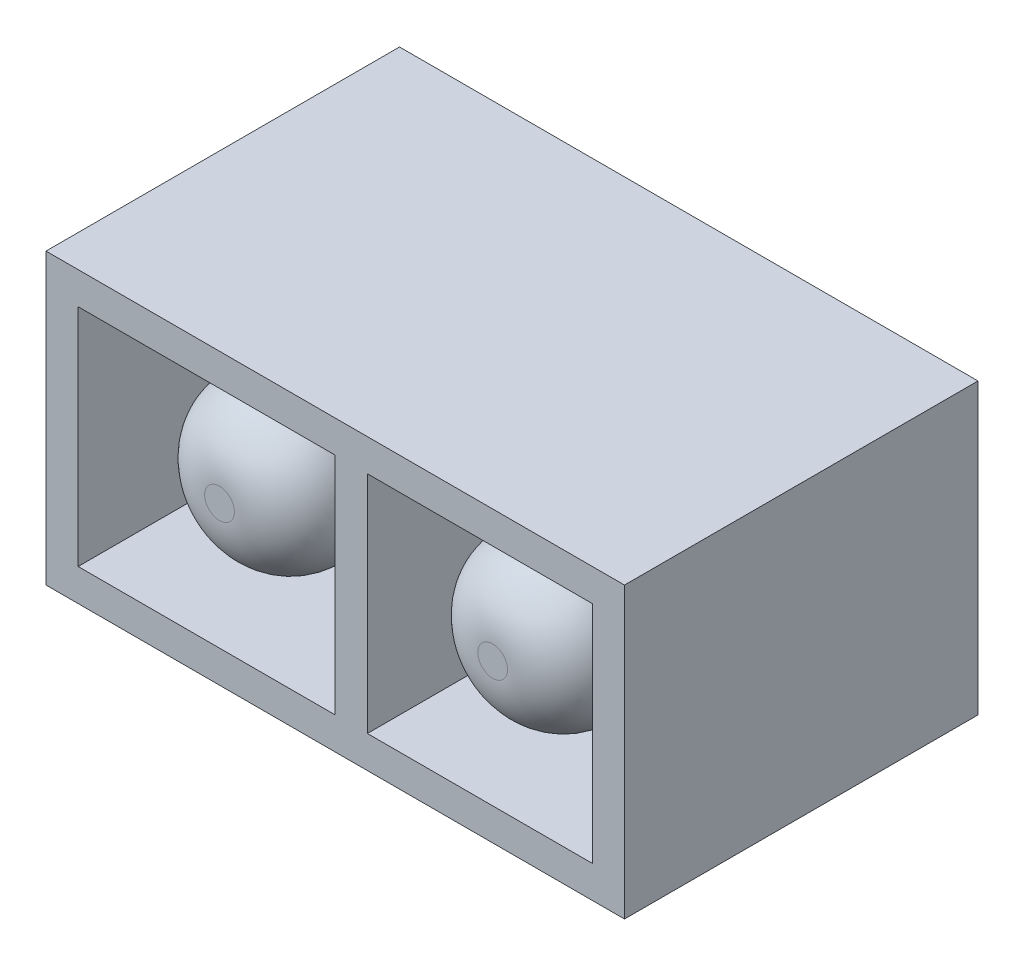
ISO-10303-21;
HEADER;
FILE_DESCRIPTION(('STEP AP214'),'2;1');
FILE_NAME('part.step','',(''),(''),'','','');
FILE_SCHEMA(('AUTOMOTIVE_DESIGN { 1 0 10303 214 1 1 1 1 }'));
ENDSEC;
DATA;
#1=APPLICATION_CONTEXT('core data for automotive mechanical design processes');
#2=APPLICATION_PROTOCOL_DEFINITION('international standard','automotive_design',2000,#1);
#3=PRODUCT_CONTEXT('',#1,'mechanical');
#4=PRODUCT('Part','Part','',(#3));
#5=PRODUCT_RELATED_PRODUCT_CATEGORY('part','',(#4));
#6=PRODUCT_DEFINITION_FORMATION('','',#4);
#7=PRODUCT_DEFINITION_CONTEXT('part definition',#1,'design');
#8=PRODUCT_DEFINITION('design','',#6,#7);
#9=PRODUCT_DEFINITION_SHAPE('','',#8);
#10=(LENGTH_UNIT() NAMED_UNIT(*) SI_UNIT(.MILLI.,.METRE.));
#11=(NAMED_UNIT(*) PLANE_ANGLE_UNIT() SI_UNIT($,.RADIAN.));
#12=(NAMED_UNIT(*) SI_UNIT($,.STERADIAN.) SOLID_ANGLE_UNIT());
#13=UNCERTAINTY_MEASURE_WITH_UNIT(LENGTH_MEASURE(1.E-05),#10,'distance_accuracy_value','');
#14=(GEOMETRIC_REPRESENTATION_CONTEXT(3) GLOBAL_UNCERTAINTY_ASSIGNED_CONTEXT((#13)) GLOBAL_UNIT_ASSIGNED_CONTEXT((#10,
#11,#12)) REPRESENTATION_CONTEXT('',''));
#15=CARTESIAN_POINT('',(0.,0.,0.));
#16=DIRECTION('',(0.,0.,1.));
#17=DIRECTION('',(1.,0.,0.));
#18=AXIS2_PLACEMENT_3D('',#15,#16,#17);
#19=CARTESIAN_POINT('',(0.,2.25,5.));
#20=DIRECTION('',(1.,0.,0.));
#21=DIRECTION('',(0.,1.,0.));
#22=AXIS2_PLACEMENT_3D('',#19,#20,#21);
#23=PLANE('',#22);
#24=DIRECTION('',(0.,-1.,0.));
#25=VECTOR('',#24,1.);
#26=CARTESIAN_POINT('',(0.,2.25,0.));
#27=LINE('',#26,#25);
#28=CARTESIAN_POINT('',(0.,1.75,0.));
#29=VERTEX_POINT('',#28);
#30=CARTESIAN_POINT('',(0.,-1.75,0.));
#31=VERTEX_POINT('',#30);
#32=EDGE_CURVE('E270',#29,#31,#27,.T.);
#33=ORIENTED_EDGE('',*,*,#32,.T.);
#34=DIRECTION('',(0.,0.,1.));
#35=VECTOR('',#34,1.);
#36=CARTESIAN_POINT('',(0.,-1.75,5.));
#37=LINE('',#36,#35);
#38=CARTESIAN_POINT('',(0.,-1.75,5.));
#39=VERTEX_POINT('',#38);
#40=EDGE_CURVE('E240',#31,#39,#37,.T.);
#41=ORIENTED_EDGE('',*,*,#40,.T.);
#42=DIRECTION('',(0.,-1.,0.));
#43=VECTOR('',#42,1.);
#44=CARTESIAN_POINT('',(0.,2.25,5.));
#45=LINE('',#44,#43);
#46=CARTESIAN_POINT('',(0.,1.75,5.));
#47=VERTEX_POINT('',#46);
#48=EDGE_CURVE('E190',#47,#39,#45,.T.);
#49=ORIENTED_EDGE('',*,*,#48,.F.);
#50=DIRECTION('',(0.,0.,-1.));
#51=VECTOR('',#50,1.);
#52=CARTESIAN_POINT('',(0.,1.75,5.));
#53=LINE('',#52,#51);
#54=EDGE_CURVE('E233',#47,#29,#53,.T.);
#55=ORIENTED_EDGE('',*,*,#54,.T.);
#56=EDGE_LOOP('',(#33,#41,#49,#55));
#57=FACE_BOUND('',#56,.T.);
#58=ADVANCED_FACE('F73',(#57),#23,.F.);
#59=CARTESIAN_POINT('',(0.5,-2.25,5.));
#60=DIRECTION('',(0.,-1.,0.));
#61=DIRECTION('',(0.,0.,-1.));
#62=AXIS2_PLACEMENT_3D('',#59,#60,#61);
#63=PLANE('',#62);
#64=DIRECTION('',(-1.,0.,0.));
#65=VECTOR('',#64,1.);
#66=CARTESIAN_POINT('',(0.5,-2.25,5.));
#67=LINE('',#66,#65);
#68=CARTESIAN_POINT('',(4.5,-2.25,5.));
#69=VERTEX_POINT('',#68);
#70=CARTESIAN_POINT('',(-4.5,-2.25,5.));
#71=VERTEX_POINT('',#70);
#72=EDGE_CURVE('E273',#69,#71,#67,.T.);
#73=ORIENTED_EDGE('',*,*,#72,.T.);
#74=DIRECTION('',(0.,0.,1.));
#75=VECTOR('',#74,1.);
#76=CARTESIAN_POINT('',(-4.5,-2.25,-0.5));
#77=LINE('',#76,#75);
#78=CARTESIAN_POINT('',(-4.5,-2.25,-0.5));
#79=VERTEX_POINT('',#78);
#80=EDGE_CURVE('E266',#79,#71,#77,.T.);
#81=ORIENTED_EDGE('',*,*,#80,.F.);
#82=DIRECTION('',(-1.,0.,0.));
#83=VECTOR('',#82,1.);
#84=CARTESIAN_POINT('',(4.5,-2.25,-0.5));
#85=LINE('',#84,#83);
#86=CARTESIAN_POINT('',(4.5,-2.25,-0.5));
#87=VERTEX_POINT('',#86);
#88=EDGE_CURVE('E243',#87,#79,#85,.T.);
#89=ORIENTED_EDGE('',*,*,#88,.F.);
#90=DIRECTION('',(0.,0.,1.));
#91=VECTOR('',#90,1.);
#92=CARTESIAN_POINT('',(4.5,-2.25,-0.5));
#93=LINE('',#92,#91);
#94=EDGE_CURVE('E254',#87,#69,#93,.T.);
#95=ORIENTED_EDGE('',*,*,#94,.T.);
#96=EDGE_LOOP('',(#73,#81,#89,#95));
#97=FACE_BOUND('',#96,.T.);
#98=ADVANCED_FACE('F326',(#97),#63,.T.);
#99=CARTESIAN_POINT('',(0.499999999999999,2.25,5.));
#100=DIRECTION('',(1.,0.,0.));
#101=DIRECTION('',(0.,1.,0.));
#102=AXIS2_PLACEMENT_3D('',#99,#100,#101);
#103=PLANE('',#102);
#104=DIRECTION('',(0.,0.,1.));
#105=VECTOR('',#104,1.);
#106=CARTESIAN_POINT('',(0.5,-1.75,5.));
#107=LINE('',#106,#105);
#108=CARTESIAN_POINT('',(0.5,-1.75,0.));
#109=VERTEX_POINT('',#108);
#110=CARTESIAN_POINT('',(0.5,-1.75,5.));
#111=VERTEX_POINT('',#110);
#112=EDGE_CURVE('E237',#109,#111,#107,.T.);
#113=ORIENTED_EDGE('',*,*,#112,.F.);
#114=DIRECTION('',(0.,-1.,0.));
#115=VECTOR('',#114,1.);
#116=CARTESIAN_POINT('',(0.499999999999999,2.25,0.));
#117=LINE('',#116,#115);
#118=CARTESIAN_POINT('',(0.5,1.75,0.));
#119=VERTEX_POINT('',#118);
#120=EDGE_CURVE('E274',#119,#109,#117,.T.);
#121=ORIENTED_EDGE('',*,*,#120,.F.);
#122=DIRECTION('',(0.,0.,-1.));
#123=VECTOR('',#122,1.);
#124=CARTESIAN_POINT('',(0.5,1.75,5.));
#125=LINE('',#124,#123);
#126=CARTESIAN_POINT('',(0.5,1.75,5.));
#127=VERTEX_POINT('',#126);
#128=EDGE_CURVE('E230',#127,#119,#125,.T.);
#129=ORIENTED_EDGE('',*,*,#128,.F.);
#130=DIRECTION('',(0.,-1.,0.));
#131=VECTOR('',#130,1.);
#132=CARTESIAN_POINT('',(0.499999999999999,2.25,5.));
#133=LINE('',#132,#131);
#134=EDGE_CURVE('E277',#127,#111,#133,.T.);
#135=ORIENTED_EDGE('',*,*,#134,.T.);
#136=EDGE_LOOP('',(#113,#121,#129,#135));
#137=FACE_BOUND('',#136,.T.);
#138=ADVANCED_FACE('F332',(#137),#103,.T.);
#139=CARTESIAN_POINT('',(0.,2.25,5.));
#140=DIRECTION('',(0.,1.,0.));
#141=DIRECTION('',(0.,0.,1.));
#142=AXIS2_PLACEMENT_3D('',#139,#140,#141);
#143=PLANE('',#142);
#144=DIRECTION('',(1.,0.,0.));
#145=VECTOR('',#144,1.);
#146=CARTESIAN_POINT('',(0.,2.25,5.));
#147=LINE('',#146,#145);
#148=CARTESIAN_POINT('',(-4.5,2.25,5.));
#149=VERTEX_POINT('',#148);
#150=CARTESIAN_POINT('',(4.5,2.25,5.));
#151=VERTEX_POINT('',#150);
#152=EDGE_CURVE('E281',#149,#151,#147,.T.);
#153=ORIENTED_EDGE('',*,*,#152,.T.);
#154=DIRECTION('',(0.,0.,1.));
#155=VECTOR('',#154,1.);
#156=CARTESIAN_POINT('',(4.5,2.25,-0.5));
#157=LINE('',#156,#155);
#158=CARTESIAN_POINT('',(4.5,2.25,-0.5));
#159=VERTEX_POINT('',#158);
#160=EDGE_CURVE('E258',#159,#151,#157,.T.);
#161=ORIENTED_EDGE('',*,*,#160,.F.);
#162=DIRECTION('',(1.,0.,0.));
#163=VECTOR('',#162,1.);
#164=CARTESIAN_POINT('',(4.5,2.25,-0.5));
#165=LINE('',#164,#163);
#166=CARTESIAN_POINT('',(-4.5,2.25,-0.5));
#167=VERTEX_POINT('',#166);
#168=EDGE_CURVE('E249',#167,#159,#165,.T.);
#169=ORIENTED_EDGE('',*,*,#168,.F.);
#170=DIRECTION('',(0.,0.,1.));
#171=VECTOR('',#170,1.);
#172=CARTESIAN_POINT('',(-4.5,2.25,-0.5));
#173=LINE('',#172,#171);
#174=EDGE_CURVE('E262',#167,#149,#173,.T.);
#175=ORIENTED_EDGE('',*,*,#174,.T.);
#176=EDGE_LOOP('',(#153,#161,#169,#175));
#177=FACE_BOUND('',#176,.T.);
#178=ADVANCED_FACE('F338',(#177),#143,.T.);
#179=CARTESIAN_POINT('',(0.,0.,5.));
#180=DIRECTION('',(0.,0.,-1.));
#181=DIRECTION('',(-1.,0.,0.));
#182=AXIS2_PLACEMENT_3D('',#179,#180,#181);
#183=PLANE('',#182);
#184=DIRECTION('',(-1.,0.,0.));
#185=VECTOR('',#184,1.);
#186=CARTESIAN_POINT('',(0.,1.75,5.));
#187=LINE('',#186,#185);
#188=CARTESIAN_POINT('',(-4.,1.75,5.));
#189=VERTEX_POINT('',#188);
#190=EDGE_CURVE('E197',#47,#189,#187,.T.);
#191=ORIENTED_EDGE('',*,*,#190,.F.);
#192=ORIENTED_EDGE('',*,*,#48,.T.);
#193=DIRECTION('',(1.,0.,0.));
#194=VECTOR('',#193,1.);
#195=CARTESIAN_POINT('',(0.,-1.75,5.));
#196=LINE('',#195,#194);
#197=CARTESIAN_POINT('',(-4.,-1.75,5.));
#198=VERTEX_POINT('',#197);
#199=EDGE_CURVE('E178',#198,#39,#196,.T.);
#200=ORIENTED_EDGE('',*,*,#199,.F.);
#201=DIRECTION('',(0.,-1.,0.));
#202=VECTOR('',#201,1.);
#203=CARTESIAN_POINT('',(-4.,0.,5.));
#204=LINE('',#203,#202);
#205=EDGE_CURVE('E164',#189,#198,#204,.T.);
#206=ORIENTED_EDGE('',*,*,#205,.F.);
#207=EDGE_LOOP('',(#191,#192,#200,#206));
#208=FACE_BOUND('',#207,.T.);
#209=ORIENTED_EDGE('',*,*,#134,.F.);
#210=CARTESIAN_POINT('',(4.,1.75,5.));
#211=VERTEX_POINT('',#210);
#212=EDGE_CURVE('E200',#211,#127,#187,.T.);
#213=ORIENTED_EDGE('',*,*,#212,.F.);
#214=DIRECTION('',(0.,1.,0.));
#215=VECTOR('',#214,1.);
#216=CARTESIAN_POINT('',(4.,0.,5.));
#217=LINE('',#216,#215);
#218=CARTESIAN_POINT('',(4.,-1.75,5.));
#219=VERTEX_POINT('',#218);
#220=EDGE_CURVE('E192',#219,#211,#217,.T.);
#221=ORIENTED_EDGE('',*,*,#220,.F.);
#222=EDGE_CURVE('E173',#111,#219,#196,.T.);
#223=ORIENTED_EDGE('',*,*,#222,.F.);
#224=EDGE_LOOP('',(#209,#213,#221,#223));
#225=FACE_BOUND('',#224,.T.);
#226=ORIENTED_EDGE('',*,*,#152,.F.);
#227=DIRECTION('',(0.,-1.,0.));
#228=VECTOR('',#227,1.);
#229=CARTESIAN_POINT('',(-4.5,2.25,5.));
#230=LINE('',#229,#228);
#231=EDGE_CURVE('E183',#149,#71,#230,.T.);
#232=ORIENTED_EDGE('',*,*,#231,.T.);
#233=ORIENTED_EDGE('',*,*,#72,.F.);
#234=DIRECTION('',(0.,1.,0.));
#235=VECTOR('',#234,1.);
#236=CARTESIAN_POINT('',(4.5,2.25,5.));
#237=LINE('',#236,#235);
#238=EDGE_CURVE('E226',#69,#151,#237,.T.);
#239=ORIENTED_EDGE('',*,*,#238,.T.);
#240=EDGE_LOOP('',(#226,#232,#233,#239));
#241=FACE_BOUND('',#240,.T.);
#242=ADVANCED_FACE('F187',(#208,#225,#241),#183,.F.);
#243=CARTESIAN_POINT('',(0.,0.,0.));
#244=DIRECTION('',(0.,0.,-1.));
#245=DIRECTION('',(-1.,0.,0.));
#246=AXIS2_PLACEMENT_3D('',#243,#244,#245);
#247=PLANE('',#246);
#248=CARTESIAN_POINT('',(2.25,0.,0.));
#249=DIRECTION('',(0.,0.,-1.));
#250=DIRECTION('',(-1.,0.,0.));
#251=AXIS2_PLACEMENT_3D('',#248,#249,#250);
#252=CIRCLE('',#251,1.5);
#253=CARTESIAN_POINT('',(0.75,0.,0.));
#254=VERTEX_POINT('',#253);
#255=EDGE_CURVE('E294',#254,#254,#252,.F.);
#256=ORIENTED_EDGE('',*,*,#255,.F.);
#257=EDGE_LOOP('',(#256));
#258=FACE_BOUND('',#257,.T.);
#259=ORIENTED_EDGE('',*,*,#120,.T.);
#260=DIRECTION('',(1.,0.,0.));
#261=VECTOR('',#260,1.);
#262=CARTESIAN_POINT('',(0.,-1.75,0.));
#263=LINE('',#262,#261);
#264=CARTESIAN_POINT('',(4.,-1.75,0.));
#265=VERTEX_POINT('',#264);
#266=EDGE_CURVE('E206',#109,#265,#263,.T.);
#267=ORIENTED_EDGE('',*,*,#266,.T.);
#268=DIRECTION('',(0.,1.,0.));
#269=VECTOR('',#268,1.);
#270=CARTESIAN_POINT('',(4.,0.,0.));
#271=LINE('',#270,#269);
#272=CARTESIAN_POINT('',(4.,1.75,0.));
#273=VERTEX_POINT('',#272);
#274=EDGE_CURVE('E209',#265,#273,#271,.T.);
#275=ORIENTED_EDGE('',*,*,#274,.T.);
#276=DIRECTION('',(-1.,0.,0.));
#277=VECTOR('',#276,1.);
#278=CARTESIAN_POINT('',(0.,1.75,0.));
#279=LINE('',#278,#277);
#280=EDGE_CURVE('E174',#273,#119,#279,.T.);
#281=ORIENTED_EDGE('',*,*,#280,.T.);
#282=EDGE_LOOP('',(#259,#267,#275,#281));
#283=FACE_BOUND('',#282,.T.);
#284=ADVANCED_FACE('F345',(#258,#283),#247,.F.);
#285=CARTESIAN_POINT('',(-4.5,-2.25,-0.5));
#286=DIRECTION('',(1.,0.,0.));
#287=DIRECTION('',(0.,0.,-1.));
#288=AXIS2_PLACEMENT_3D('',#285,#286,#287);
#289=PLANE('',#288);
#290=ORIENTED_EDGE('',*,*,#80,.T.);
#291=ORIENTED_EDGE('',*,*,#231,.F.);
#292=ORIENTED_EDGE('',*,*,#174,.F.);
#293=DIRECTION('',(0.,1.,0.));
#294=VECTOR('',#293,1.);
#295=CARTESIAN_POINT('',(-4.5,-2.25,-0.5));
#296=LINE('',#295,#294);
#297=EDGE_CURVE('E246',#79,#167,#296,.T.);
#298=ORIENTED_EDGE('',*,*,#297,.F.);
#299=EDGE_LOOP('',(#290,#291,#292,#298));
#300=FACE_BOUND('',#299,.T.);
#301=ADVANCED_FACE('F346',(#300),#289,.F.);
#302=CARTESIAN_POINT('',(4.5,-2.25,-0.5));
#303=DIRECTION('',(-1.,0.,0.));
#304=DIRECTION('',(0.,0.,1.));
#305=AXIS2_PLACEMENT_3D('',#302,#303,#304);
#306=PLANE('',#305);
#307=ORIENTED_EDGE('',*,*,#160,.T.);
#308=ORIENTED_EDGE('',*,*,#238,.F.);
#309=ORIENTED_EDGE('',*,*,#94,.F.);
#310=DIRECTION('',(0.,-1.,0.));
#311=VECTOR('',#310,1.);
#312=CARTESIAN_POINT('',(4.5,-2.25,-0.5));
#313=LINE('',#312,#311);
#314=EDGE_CURVE('E97',#159,#87,#313,.T.);
#315=ORIENTED_EDGE('',*,*,#314,.F.);
#316=EDGE_LOOP('',(#307,#308,#309,#315));
#317=FACE_BOUND('',#316,.T.);
#318=ADVANCED_FACE('F349',(#317),#306,.F.);
#319=CARTESIAN_POINT('',(0.,0.,-0.5));
#320=DIRECTION('',(0.,0.,-1.));
#321=DIRECTION('',(-1.,0.,0.));
#322=AXIS2_PLACEMENT_3D('',#319,#320,#321);
#323=PLANE('',#322);
#324=ORIENTED_EDGE('',*,*,#88,.T.);
#325=ORIENTED_EDGE('',*,*,#297,.T.);
#326=ORIENTED_EDGE('',*,*,#168,.T.);
#327=ORIENTED_EDGE('',*,*,#314,.T.);
#328=EDGE_LOOP('',(#324,#325,#326,#327));
#329=FACE_BOUND('',#328,.T.);
#330=ADVANCED_FACE('F353',(#329),#323,.T.);
#331=CARTESIAN_POINT('',(-2.,0.,0.));
#332=DIRECTION('',(0.,0.,-1.));
#333=DIRECTION('',(-1.,0.,0.));
#334=AXIS2_PLACEMENT_3D('',#331,#332,#333);
#335=CIRCLE('',#334,1.5);
#336=CARTESIAN_POINT('',(-3.5,0.,0.));
#337=VERTEX_POINT('',#336);
#338=EDGE_CURVE('E298',#337,#337,#335,.F.);
#339=ORIENTED_EDGE('',*,*,#338,.F.);
#340=EDGE_LOOP('',(#339));
#341=FACE_BOUND('',#340,.T.);
#342=DIRECTION('',(0.,-1.,0.));
#343=VECTOR('',#342,1.);
#344=CARTESIAN_POINT('',(-4.,0.,0.));
#345=LINE('',#344,#343);
#346=CARTESIAN_POINT('',(-4.,1.75,0.));
#347=VERTEX_POINT('',#346);
#348=CARTESIAN_POINT('',(-4.,-1.75,0.));
#349=VERTEX_POINT('',#348);
#350=EDGE_CURVE('E203',#347,#349,#345,.T.);
#351=ORIENTED_EDGE('',*,*,#350,.T.);
#352=EDGE_CURVE('E181',#349,#31,#263,.T.);
#353=ORIENTED_EDGE('',*,*,#352,.T.);
#354=ORIENTED_EDGE('',*,*,#32,.F.);
#355=DIRECTION('',(-1.,0.,0.));
#356=VECTOR('',#355,1.);
#357=CARTESIAN_POINT('',(0.,1.75,0.));
#358=LINE('',#357,#356);
#359=EDGE_CURVE('E284',#29,#347,#358,.T.);
#360=ORIENTED_EDGE('',*,*,#359,.T.);
#361=EDGE_LOOP('',(#351,#353,#354,#360));
#362=FACE_BOUND('',#361,.T.);
#363=ADVANCED_FACE('F355',(#341,#362),#247,.F.);
#364=CARTESIAN_POINT('',(0.,-1.75,5.));
#365=DIRECTION('',(0.,1.,0.));
#366=DIRECTION('',(0.,0.,1.));
#367=AXIS2_PLACEMENT_3D('',#364,#365,#366);
#368=PLANE('',#367);
#369=ORIENTED_EDGE('',*,*,#40,.F.);
#370=ORIENTED_EDGE('',*,*,#352,.F.);
#371=DIRECTION('',(0.,0.,-1.));
#372=VECTOR('',#371,1.);
#373=CARTESIAN_POINT('',(-4.,-1.75,5.));
#374=LINE('',#373,#372);
#375=EDGE_CURVE('E167',#198,#349,#374,.T.);
#376=ORIENTED_EDGE('',*,*,#375,.F.);
#377=ORIENTED_EDGE('',*,*,#199,.T.);
#378=EDGE_LOOP('',(#369,#370,#376,#377));
#379=FACE_BOUND('',#378,.T.);
#380=ADVANCED_FACE('F177',(#379),#368,.T.);
#381=CARTESIAN_POINT('',(0.,1.75,5.));
#382=DIRECTION('',(0.,-1.,0.));
#383=DIRECTION('',(0.,0.,-1.));
#384=AXIS2_PLACEMENT_3D('',#381,#382,#383);
#385=PLANE('',#384);
#386=ORIENTED_EDGE('',*,*,#54,.F.);
#387=ORIENTED_EDGE('',*,*,#190,.T.);
#388=DIRECTION('',(0.,0.,-1.));
#389=VECTOR('',#388,1.);
#390=CARTESIAN_POINT('',(-4.,1.75,5.));
#391=LINE('',#390,#389);
#392=EDGE_CURVE('E89',#189,#347,#391,.T.);
#393=ORIENTED_EDGE('',*,*,#392,.T.);
#394=ORIENTED_EDGE('',*,*,#359,.F.);
#395=EDGE_LOOP('',(#386,#387,#393,#394));
#396=FACE_BOUND('',#395,.T.);
#397=ADVANCED_FACE('F364',(#396),#385,.T.);
#398=CARTESIAN_POINT('',(-4.,0.,5.));
#399=DIRECTION('',(1.,0.,0.));
#400=DIRECTION('',(0.,0.,-1.));
#401=AXIS2_PLACEMENT_3D('',#398,#399,#400);
#402=PLANE('',#401);
#403=ORIENTED_EDGE('',*,*,#350,.F.);
#404=ORIENTED_EDGE('',*,*,#392,.F.);
#405=ORIENTED_EDGE('',*,*,#205,.T.);
#406=ORIENTED_EDGE('',*,*,#375,.T.);
#407=EDGE_LOOP('',(#403,#404,#405,#406));
#408=FACE_BOUND('',#407,.T.);
#409=ADVANCED_FACE('F166',(#408),#402,.T.);
#410=ORIENTED_EDGE('',*,*,#266,.F.);
#411=ORIENTED_EDGE('',*,*,#112,.T.);
#412=ORIENTED_EDGE('',*,*,#222,.T.);
#413=DIRECTION('',(0.,0.,-1.));
#414=VECTOR('',#413,1.);
#415=CARTESIAN_POINT('',(4.,-1.75,5.));
#416=LINE('',#415,#414);
#417=EDGE_CURVE('E184',#219,#265,#416,.T.);
#418=ORIENTED_EDGE('',*,*,#417,.T.);
#419=EDGE_LOOP('',(#410,#411,#412,#418));
#420=FACE_BOUND('',#419,.T.);
#421=ADVANCED_FACE('F363',(#420),#368,.T.);
#422=CARTESIAN_POINT('',(4.,0.,5.));
#423=DIRECTION('',(-1.,0.,0.));
#424=DIRECTION('',(0.,0.,1.));
#425=AXIS2_PLACEMENT_3D('',#422,#423,#424);
#426=PLANE('',#425);
#427=ORIENTED_EDGE('',*,*,#274,.F.);
#428=ORIENTED_EDGE('',*,*,#417,.F.);
#429=ORIENTED_EDGE('',*,*,#220,.T.);
#430=DIRECTION('',(0.,0.,-1.));
#431=VECTOR('',#430,1.);
#432=CARTESIAN_POINT('',(4.,1.75,5.));
#433=LINE('',#432,#431);
#434=EDGE_CURVE('E218',#211,#273,#433,.T.);
#435=ORIENTED_EDGE('',*,*,#434,.T.);
#436=EDGE_LOOP('',(#427,#428,#429,#435));
#437=FACE_BOUND('',#436,.T.);
#438=ADVANCED_FACE('F367',(#437),#426,.T.);
#439=ORIENTED_EDGE('',*,*,#212,.T.);
#440=ORIENTED_EDGE('',*,*,#128,.T.);
#441=ORIENTED_EDGE('',*,*,#280,.F.);
#442=ORIENTED_EDGE('',*,*,#434,.F.);
#443=EDGE_LOOP('',(#439,#440,#441,#442));
#444=FACE_BOUND('',#443,.T.);
#445=ADVANCED_FACE('F371',(#444),#385,.T.);
#446=CARTESIAN_POINT('',(2.25,0.,0.));
#447=DIRECTION('',(0.,0.,-1.));
#448=DIRECTION('',(1.,0.,0.));
#449=AXIS2_PLACEMENT_3D('',#446,#447,#448);
#450=CONICAL_SURFACE('',#449,1.5,0.0698131700797733);
#451=CARTESIAN_POINT('',(2.25,0.,3.86975647374413));
#452=DIRECTION('',(0.,0.,-1.));
#453=DIRECTION('',(-1.,0.,0.));
#454=AXIS2_PLACEMENT_3D('',#451,#452,#453);
#455=CIRCLE('',#454,1.22940026679331);
#456=CARTESIAN_POINT('',(1.02059973320669,0.,3.86975647374413));
#457=VERTEX_POINT('',#456);
#458=EDGE_CURVE('E12',#457,#457,#455,.T.);
#459=ORIENTED_EDGE('',*,*,#458,.T.);
#460=EDGE_LOOP('',(#459));
#461=FACE_BOUND('',#460,.T.);
#462=ORIENTED_EDGE('',*,*,#255,.T.);
#463=EDGE_LOOP('',(#462));
#464=FACE_BOUND('',#463,.T.);
#465=ADVANCED_FACE('F375',(#461,#464),#450,.T.);
#466=CARTESIAN_POINT('',(2.25,0.,4.8));
#467=DIRECTION('',(0.,0.,1.));
#468=DIRECTION('',(1.,0.,0.));
#469=AXIS2_PLACEMENT_3D('',#466,#467,#468);
#470=PLANE('',#469);
#471=CARTESIAN_POINT('',(2.25,0.,4.8));
#472=DIRECTION('',(0.,0.,1.));
#473=DIRECTION('',(1.,0.,0.));
#474=AXIS2_PLACEMENT_3D('',#471,#472,#473);
#475=CIRCLE('',#474,0.231836216533488);
#476=CARTESIAN_POINT('',(2.48183621653349,0.,4.8));
#477=VERTEX_POINT('',#476);
#478=EDGE_CURVE('E82',#477,#477,#475,.T.);
#479=ORIENTED_EDGE('',*,*,#478,.T.);
#480=EDGE_LOOP('',(#479));
#481=FACE_BOUND('',#480,.T.);
#482=ADVANCED_FACE('F313',(#481),#470,.T.);
#483=CARTESIAN_POINT('',(-2.,0.,0.));
#484=DIRECTION('',(0.,0.,-1.));
#485=DIRECTION('',(1.,0.,0.));
#486=AXIS2_PLACEMENT_3D('',#483,#484,#485);
#487=CONICAL_SURFACE('',#486,1.5,0.0698131700797733);
#488=CARTESIAN_POINT('',(-2.,0.,3.86975647374413));
#489=DIRECTION('',(0.,0.,-1.));
#490=DIRECTION('',(-1.,0.,0.));
#491=AXIS2_PLACEMENT_3D('',#488,#489,#490);
#492=CIRCLE('',#491,1.22940026679331);
#493=CARTESIAN_POINT('',(-3.22940026679331,0.,3.86975647374413));
#494=VERTEX_POINT('',#493);
#495=EDGE_CURVE('E306',#494,#494,#492,.T.);
#496=ORIENTED_EDGE('',*,*,#495,.T.);
#497=EDGE_LOOP('',(#496));
#498=FACE_BOUND('',#497,.T.);
#499=ORIENTED_EDGE('',*,*,#338,.T.);
#500=EDGE_LOOP('',(#499));
#501=FACE_BOUND('',#500,.T.);
#502=ADVANCED_FACE('F381',(#498,#501),#487,.T.);
#503=CARTESIAN_POINT('',(-2.,0.,4.8));
#504=DIRECTION('',(0.,0.,1.));
#505=DIRECTION('',(1.,0.,0.));
#506=AXIS2_PLACEMENT_3D('',#503,#504,#505);
#507=PLANE('',#506);
#508=CARTESIAN_POINT('',(-2.,0.,4.8));
#509=DIRECTION('',(0.,0.,1.));
#510=DIRECTION('',(1.,0.,0.));
#511=AXIS2_PLACEMENT_3D('',#508,#509,#510);
#512=CIRCLE('',#511,0.231836216533488);
#513=CARTESIAN_POINT('',(-1.76816378346651,0.,4.8));
#514=VERTEX_POINT('',#513);
#515=EDGE_CURVE('E302',#514,#514,#512,.T.);
#516=ORIENTED_EDGE('',*,*,#515,.T.);
#517=EDGE_LOOP('',(#516));
#518=FACE_BOUND('',#517,.T.);
#519=ADVANCED_FACE('F322',(#518),#507,.T.);
#520=CARTESIAN_POINT('',(-2.,0.,3.8));
#521=DIRECTION('',(0.,0.,1.));
#522=DIRECTION('',(1.,0.,0.));
#523=AXIS2_PLACEMENT_3D('',#520,#521,#522);
#524=DEGENERATE_TOROIDAL_SURFACE('',#523,0.231836216533488,1.,.T.);
#525=ORIENTED_EDGE('',*,*,#495,.F.);
#526=EDGE_LOOP('',(#525));
#527=FACE_BOUND('',#526,.T.);
#528=ORIENTED_EDGE('',*,*,#515,.F.);
#529=EDGE_LOOP('',(#528));
#530=FACE_BOUND('',#529,.T.);
#531=ADVANCED_FACE('F316',(#527,#530),#524,.T.);
#532=CARTESIAN_POINT('',(2.25,0.,3.8));
#533=DIRECTION('',(0.,0.,1.));
#534=DIRECTION('',(1.,0.,0.));
#535=AXIS2_PLACEMENT_3D('',#532,#533,#534);
#536=DEGENERATE_TOROIDAL_SURFACE('',#535,0.231836216533488,1.,.T.);
#537=ORIENTED_EDGE('',*,*,#458,.F.);
#538=EDGE_LOOP('',(#537));
#539=FACE_BOUND('',#538,.T.);
#540=ORIENTED_EDGE('',*,*,#478,.F.);
#541=EDGE_LOOP('',(#540));
#542=FACE_BOUND('',#541,.T.);
#543=ADVANCED_FACE('F75',(#539,#542),#536,.T.);
#544=CLOSED_SHELL('',(#58,#98,#138,#178,#242,#284,#301,#318,#330,#363,#380,#397,#409,#421,#438,
#445,#465,#482,#502,#519,#531,#543));
#545=MANIFOLD_SOLID_BREP('B2',#544);
#546=ADVANCED_BREP_SHAPE_REPRESENTATION('',(#18,#545),#14);
#547=SHAPE_DEFINITION_REPRESENTATION(#9,#546);
ENDSEC;
END-ISO-10303-21;
